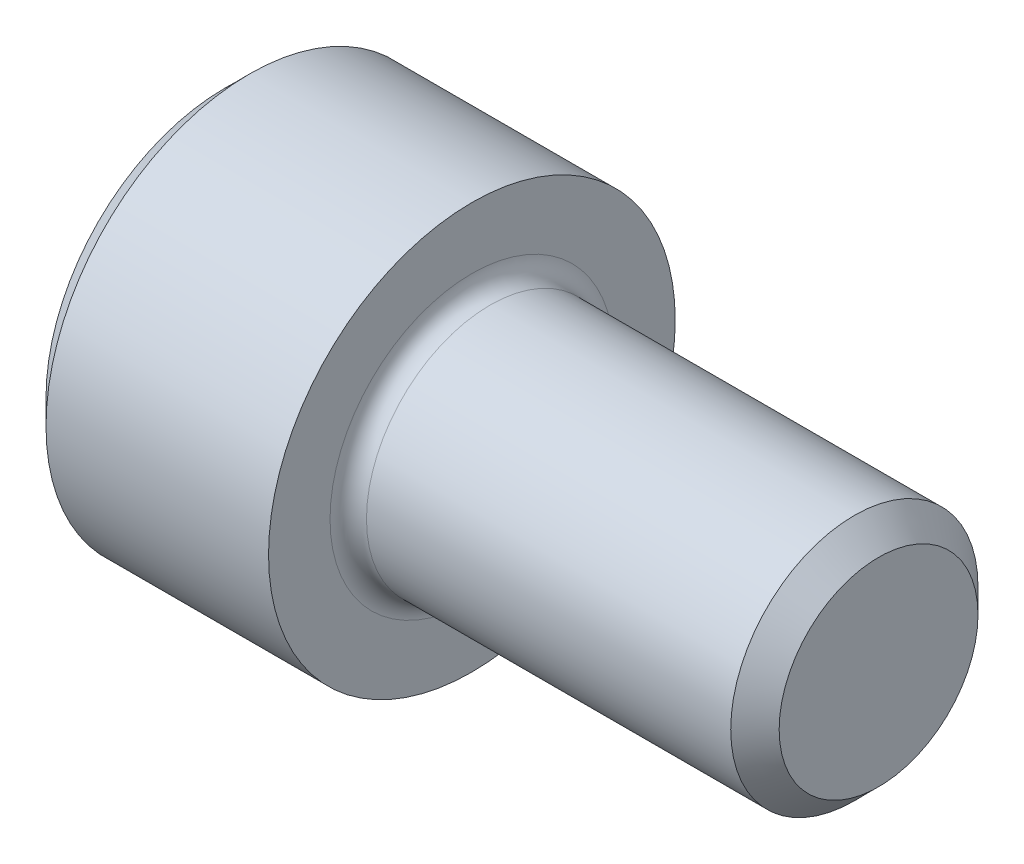
ISO-10303-21;
HEADER;
FILE_DESCRIPTION(('STEP AP214'),'2;1');
FILE_NAME('part.step','',(''),(''),'','','');
FILE_SCHEMA(('AUTOMOTIVE_DESIGN { 1 0 10303 214 1 1 1 1 }'));
ENDSEC;
DATA;
#1=APPLICATION_CONTEXT('core data for automotive mechanical design processes');
#2=APPLICATION_PROTOCOL_DEFINITION('international standard','automotive_design',2000,#1);
#3=PRODUCT_CONTEXT('',#1,'mechanical');
#4=PRODUCT('Part','Part','',(#3));
#5=PRODUCT_RELATED_PRODUCT_CATEGORY('part','',(#4));
#6=PRODUCT_DEFINITION_FORMATION('','',#4);
#7=PRODUCT_DEFINITION_CONTEXT('part definition',#1,'design');
#8=PRODUCT_DEFINITION('design','',#6,#7);
#9=PRODUCT_DEFINITION_SHAPE('','',#8);
#10=(LENGTH_UNIT() NAMED_UNIT(*) SI_UNIT(.MILLI.,.METRE.));
#11=(NAMED_UNIT(*) PLANE_ANGLE_UNIT() SI_UNIT($,.RADIAN.));
#12=(NAMED_UNIT(*) SI_UNIT($,.STERADIAN.) SOLID_ANGLE_UNIT());
#13=UNCERTAINTY_MEASURE_WITH_UNIT(LENGTH_MEASURE(1.E-05),#10,'distance_accuracy_value','');
#14=(GEOMETRIC_REPRESENTATION_CONTEXT(3) GLOBAL_UNCERTAINTY_ASSIGNED_CONTEXT((#13)) GLOBAL_UNIT_ASSIGNED_CONTEXT((#10,
#11,#12)) REPRESENTATION_CONTEXT('',''));
#15=CARTESIAN_POINT('',(0.,0.,0.));
#16=DIRECTION('',(0.,0.,1.));
#17=DIRECTION('',(1.,0.,0.));
#18=AXIS2_PLACEMENT_3D('',#15,#16,#17);
#19=CARTESIAN_POINT('',(0.,0.,0.));
#20=DIRECTION('',(-1.,0.,0.));
#21=DIRECTION('',(0.,0.,1.));
#22=AXIS2_PLACEMENT_3D('',#19,#20,#21);
#23=PLANE('',#22);
#24=DIRECTION('',(0.,-0.499999999999998,0.86602540378444));
#25=VECTOR('',#24,1.);
#26=CARTESIAN_POINT('',(0.,2.2920921156882,0.));
#27=LINE('',#26,#25);
#28=CARTESIAN_POINT('',(0.,2.2920921156882,0.));
#29=VERTEX_POINT('',#28);
#30=CARTESIAN_POINT('',(0.,1.14604605784411,1.98501));
#31=VERTEX_POINT('',#30);
#32=EDGE_CURVE('E259',#29,#31,#27,.T.);
#33=ORIENTED_EDGE('',*,*,#32,.T.);
#34=DIRECTION('',(0.,1.,0.));
#35=VECTOR('',#34,1.);
#36=CARTESIAN_POINT('',(0.,-1.14604605784409,1.98501));
#37=LINE('',#36,#35);
#38=CARTESIAN_POINT('',(0.,-1.14604605784409,1.98501));
#39=VERTEX_POINT('',#38);
#40=EDGE_CURVE('E130',#39,#31,#37,.T.);
#41=ORIENTED_EDGE('',*,*,#40,.F.);
#42=DIRECTION('',(0.,-0.500000000000001,-0.866025403784438));
#43=VECTOR('',#42,1.);
#44=CARTESIAN_POINT('',(0.,-1.14604605784409,1.98501));
#45=LINE('',#44,#43);
#46=CARTESIAN_POINT('',(0.,-2.29209211568819,0.));
#47=VERTEX_POINT('',#46);
#48=EDGE_CURVE('E262',#39,#47,#45,.T.);
#49=ORIENTED_EDGE('',*,*,#48,.T.);
#50=DIRECTION('',(0.,0.499999999999998,-0.86602540378444));
#51=VECTOR('',#50,1.);
#52=CARTESIAN_POINT('',(0.,-2.29209211568819,0.));
#53=LINE('',#52,#51);
#54=CARTESIAN_POINT('',(0.,-1.1460460578441,-1.98501));
#55=VERTEX_POINT('',#54);
#56=EDGE_CURVE('E265',#47,#55,#53,.T.);
#57=ORIENTED_EDGE('',*,*,#56,.T.);
#58=DIRECTION('',(0.,-1.,0.));
#59=VECTOR('',#58,1.);
#60=CARTESIAN_POINT('',(0.,1.1460460578441,-1.98501));
#61=LINE('',#60,#59);
#62=CARTESIAN_POINT('',(0.,1.1460460578441,-1.98501));
#63=VERTEX_POINT('',#62);
#64=EDGE_CURVE('E268',#63,#55,#61,.T.);
#65=ORIENTED_EDGE('',*,*,#64,.F.);
#66=DIRECTION('',(0.,-0.500000000000001,-0.866025403784438));
#67=VECTOR('',#66,1.);
#68=CARTESIAN_POINT('',(0.,2.2920921156882,0.));
#69=LINE('',#68,#67);
#70=EDGE_CURVE('E125',#29,#63,#69,.T.);
#71=ORIENTED_EDGE('',*,*,#70,.F.);
#72=EDGE_LOOP('',(#33,#41,#49,#57,#65,#71));
#73=FACE_BOUND('',#72,.T.);
#74=CARTESIAN_POINT('',(0.,0.,0.));
#75=DIRECTION('',(-1.,0.,0.));
#76=DIRECTION('',(0.,0.,1.));
#77=AXIS2_PLACEMENT_3D('',#74,#75,#76);
#78=CIRCLE('',#77,3.48615);
#79=CARTESIAN_POINT('',(0.,0.,3.48615));
#80=VERTEX_POINT('',#79);
#81=EDGE_CURVE('E154',#80,#80,#78,.T.);
#82=ORIENTED_EDGE('',*,*,#81,.T.);
#83=EDGE_LOOP('',(#82));
#84=FACE_BOUND('',#83,.T.);
#85=ADVANCED_FACE('F34',(#73,#84),#23,.T.);
#86=CARTESIAN_POINT('',(0.,0.,0.));
#87=DIRECTION('',(1.,0.,0.));
#88=DIRECTION('',(0.,0.,-1.));
#89=AXIS2_PLACEMENT_3D('',#86,#87,#88);
#90=CONICAL_SURFACE('',#89,3.48615,0.785398163397446);
#91=CARTESIAN_POINT('',(0.4826,0.,0.));
#92=DIRECTION('',(-1.,0.,0.));
#93=DIRECTION('',(0.,0.,1.));
#94=AXIS2_PLACEMENT_3D('',#91,#92,#93);
#95=CIRCLE('',#94,3.96875);
#96=CARTESIAN_POINT('',(0.4826,0.,3.96875));
#97=VERTEX_POINT('',#96);
#98=EDGE_CURVE('E151',#97,#97,#95,.T.);
#99=ORIENTED_EDGE('',*,*,#98,.T.);
#100=EDGE_LOOP('',(#99));
#101=FACE_BOUND('',#100,.T.);
#102=ORIENTED_EDGE('',*,*,#81,.F.);
#103=EDGE_LOOP('',(#102));
#104=FACE_BOUND('',#103,.T.);
#105=ADVANCED_FACE('F175',(#101,#104),#90,.T.);
#106=CARTESIAN_POINT('',(-31.75,0.,0.));
#107=DIRECTION('',(-1.,0.,0.));
#108=DIRECTION('',(0.,0.,1.));
#109=AXIS2_PLACEMENT_3D('',#106,#107,#108);
#110=CYLINDRICAL_SURFACE('',#109,3.96875);
#111=CARTESIAN_POINT('',(4.826,0.,0.));
#112=DIRECTION('',(-1.,0.,0.));
#113=DIRECTION('',(0.,0.,1.));
#114=AXIS2_PLACEMENT_3D('',#111,#112,#113);
#115=CIRCLE('',#114,3.96875);
#116=CARTESIAN_POINT('',(4.826,0.,3.96875));
#117=VERTEX_POINT('',#116);
#118=EDGE_CURVE('E148',#117,#117,#115,.T.);
#119=ORIENTED_EDGE('',*,*,#118,.T.);
#120=EDGE_LOOP('',(#119));
#121=FACE_BOUND('',#120,.T.);
#122=ORIENTED_EDGE('',*,*,#98,.F.);
#123=EDGE_LOOP('',(#122));
#124=FACE_BOUND('',#123,.T.);
#125=ADVANCED_FACE('F180',(#121,#124),#110,.T.);
#126=CARTESIAN_POINT('',(4.826,3.96875,0.));
#127=DIRECTION('',(1.,0.,0.));
#128=DIRECTION('',(0.,0.,-1.));
#129=AXIS2_PLACEMENT_3D('',#126,#127,#128);
#130=PLANE('',#129);
#131=CARTESIAN_POINT('',(4.826,0.,0.));
#132=DIRECTION('',(1.,0.,0.));
#133=DIRECTION('',(0.,0.,-1.));
#134=AXIS2_PLACEMENT_3D('',#131,#132,#133);
#135=CIRCLE('',#134,2.7686);
#136=CARTESIAN_POINT('',(4.826,0.,-2.7686));
#137=VERTEX_POINT('',#136);
#138=EDGE_CURVE('E42',#137,#137,#135,.F.);
#139=ORIENTED_EDGE('',*,*,#138,.T.);
#140=EDGE_LOOP('',(#139));
#141=FACE_BOUND('',#140,.T.);
#142=ORIENTED_EDGE('',*,*,#118,.F.);
#143=EDGE_LOOP('',(#142));
#144=FACE_BOUND('',#143,.T.);
#145=ADVANCED_FACE('F159',(#141,#144),#130,.T.);
#146=CARTESIAN_POINT('',(-31.75,0.,0.));
#147=DIRECTION('',(-1.,0.,0.));
#148=DIRECTION('',(0.,0.,1.));
#149=AXIS2_PLACEMENT_3D('',#146,#147,#148);
#150=CYLINDRICAL_SURFACE('',#149,2.413);
#151=CARTESIAN_POINT('',(5.1816,0.,0.));
#152=DIRECTION('',(1.,0.,0.));
#153=DIRECTION('',(0.,0.,-1.));
#154=AXIS2_PLACEMENT_3D('',#151,#152,#153);
#155=CIRCLE('',#154,2.413);
#156=CARTESIAN_POINT('',(5.1816,0.,-2.413));
#157=VERTEX_POINT('',#156);
#158=EDGE_CURVE('E11',#157,#157,#155,.T.);
#159=ORIENTED_EDGE('',*,*,#158,.T.);
#160=EDGE_LOOP('',(#159));
#161=FACE_BOUND('',#160,.T.);
#162=CARTESIAN_POINT('',(12.29106,0.,0.));
#163=DIRECTION('',(-1.,0.,0.));
#164=DIRECTION('',(0.,0.,1.));
#165=AXIS2_PLACEMENT_3D('',#162,#163,#164);
#166=CIRCLE('',#165,2.413);
#167=CARTESIAN_POINT('',(12.29106,0.,2.413));
#168=VERTEX_POINT('',#167);
#169=EDGE_CURVE('E145',#168,#168,#166,.T.);
#170=ORIENTED_EDGE('',*,*,#169,.T.);
#171=EDGE_LOOP('',(#170));
#172=FACE_BOUND('',#171,.T.);
#173=ADVANCED_FACE('F190',(#161,#172),#150,.T.);
#174=CARTESIAN_POINT('',(12.7635,0.,0.));
#175=DIRECTION('',(-1.,0.,0.));
#176=DIRECTION('',(0.,0.,1.));
#177=AXIS2_PLACEMENT_3D('',#174,#175,#176);
#178=CONICAL_SURFACE('',#177,1.94056,0.785398163397473);
#179=ORIENTED_EDGE('',*,*,#169,.F.);
#180=EDGE_LOOP('',(#179));
#181=FACE_BOUND('',#180,.T.);
#182=CARTESIAN_POINT('',(12.7635,0.,0.));
#183=DIRECTION('',(-1.,0.,0.));
#184=DIRECTION('',(0.,0.,1.));
#185=AXIS2_PLACEMENT_3D('',#182,#183,#184);
#186=CIRCLE('',#185,1.94056);
#187=CARTESIAN_POINT('',(12.7635,0.,1.94056));
#188=VERTEX_POINT('',#187);
#189=EDGE_CURVE('E141',#188,#188,#186,.T.);
#190=ORIENTED_EDGE('',*,*,#189,.T.);
#191=EDGE_LOOP('',(#190));
#192=FACE_BOUND('',#191,.T.);
#193=ADVANCED_FACE('F170',(#181,#192),#178,.T.);
#194=CARTESIAN_POINT('',(12.7635,1.94056,0.));
#195=DIRECTION('',(1.,0.,0.));
#196=DIRECTION('',(0.,0.,-1.));
#197=AXIS2_PLACEMENT_3D('',#194,#195,#196);
#198=PLANE('',#197);
#199=ORIENTED_EDGE('',*,*,#189,.F.);
#200=EDGE_LOOP('',(#199));
#201=FACE_BOUND('',#200,.T.);
#202=ADVANCED_FACE('F163',(#201),#198,.T.);
#203=CARTESIAN_POINT('',(5.1816,0.,0.));
#204=DIRECTION('',(1.,0.,0.));
#205=DIRECTION('',(0.,0.,-1.));
#206=AXIS2_PLACEMENT_3D('',#203,#204,#205);
#207=TOROIDAL_SURFACE('',#206,2.7686,0.3556);
#208=ORIENTED_EDGE('',*,*,#158,.F.);
#209=EDGE_LOOP('',(#208));
#210=FACE_BOUND('',#209,.T.);
#211=ORIENTED_EDGE('',*,*,#138,.F.);
#212=EDGE_LOOP('',(#211));
#213=FACE_BOUND('',#212,.T.);
#214=ADVANCED_FACE('F36',(#210,#213),#207,.F.);
#215=CARTESIAN_POINT('',(2.286,2.2920921156882,0.));
#216=DIRECTION('',(0.,-0.86602540378444,-0.499999999999998));
#217=DIRECTION('',(0.,0.499999999999998,-0.86602540378444));
#218=AXIS2_PLACEMENT_3D('',#215,#216,#217);
#219=PLANE('',#218);
#220=ORIENTED_EDGE('',*,*,#32,.F.);
#221=DIRECTION('',(-1.,0.,0.));
#222=VECTOR('',#221,1.);
#223=CARTESIAN_POINT('',(2.286,2.2920921156882,0.));
#224=LINE('',#223,#222);
#225=CARTESIAN_POINT('',(2.286,2.2920921156882,0.));
#226=VERTEX_POINT('',#225);
#227=EDGE_CURVE('E249',#226,#29,#224,.T.);
#228=ORIENTED_EDGE('',*,*,#227,.F.);
#229=DIRECTION('',(0.,-0.499999999999998,0.86602540378444));
#230=VECTOR('',#229,1.);
#231=CARTESIAN_POINT('',(2.286,2.2920921156882,0.));
#232=LINE('',#231,#230);
#233=CARTESIAN_POINT('',(2.286,1.71906908676615,0.992504999999998));
#234=VERTEX_POINT('',#233);
#235=EDGE_CURVE('E117',#226,#234,#232,.T.);
#236=ORIENTED_EDGE('',*,*,#235,.T.);
#237=CARTESIAN_POINT('',(2.286,1.14604605784411,1.98501));
#238=VERTEX_POINT('',#237);
#239=EDGE_CURVE('E108',#234,#238,#232,.T.);
#240=ORIENTED_EDGE('',*,*,#239,.T.);
#241=DIRECTION('',(-1.,0.,0.));
#242=VECTOR('',#241,1.);
#243=CARTESIAN_POINT('',(2.286,1.14604605784411,1.98501));
#244=LINE('',#243,#242);
#245=EDGE_CURVE('E122',#238,#31,#244,.T.);
#246=ORIENTED_EDGE('',*,*,#245,.T.);
#247=EDGE_LOOP('',(#220,#228,#236,#240,#246));
#248=FACE_BOUND('',#247,.T.);
#249=ADVANCED_FACE('F121',(#248),#219,.T.);
#250=CARTESIAN_POINT('',(2.286,-1.14604605784409,1.98501));
#251=DIRECTION('',(0.,0.,1.));
#252=DIRECTION('',(0.,-1.,0.));
#253=AXIS2_PLACEMENT_3D('',#250,#251,#252);
#254=PLANE('',#253);
#255=ORIENTED_EDGE('',*,*,#40,.T.);
#256=ORIENTED_EDGE('',*,*,#245,.F.);
#257=DIRECTION('',(0.,1.,0.));
#258=VECTOR('',#257,1.);
#259=CARTESIAN_POINT('',(2.286,-1.14604605784409,1.98501));
#260=LINE('',#259,#258);
#261=CARTESIAN_POINT('',(2.286,0.,1.98501));
#262=VERTEX_POINT('',#261);
#263=EDGE_CURVE('E105',#262,#238,#260,.T.);
#264=ORIENTED_EDGE('',*,*,#263,.F.);
#265=CARTESIAN_POINT('',(2.286,-1.14604605784409,1.98501));
#266=VERTEX_POINT('',#265);
#267=EDGE_CURVE('E116',#266,#262,#260,.T.);
#268=ORIENTED_EDGE('',*,*,#267,.F.);
#269=DIRECTION('',(-1.,0.,0.));
#270=VECTOR('',#269,1.);
#271=CARTESIAN_POINT('',(2.286,-1.14604605784409,1.98501));
#272=LINE('',#271,#270);
#273=EDGE_CURVE('E132',#266,#39,#272,.T.);
#274=ORIENTED_EDGE('',*,*,#273,.T.);
#275=EDGE_LOOP('',(#255,#256,#264,#268,#274));
#276=FACE_BOUND('',#275,.T.);
#277=ADVANCED_FACE('F127',(#276),#254,.F.);
#278=CARTESIAN_POINT('',(2.286,-1.14604605784409,1.98501));
#279=DIRECTION('',(0.,0.866025403784438,-0.500000000000001));
#280=DIRECTION('',(0.,0.500000000000001,0.866025403784438));
#281=AXIS2_PLACEMENT_3D('',#278,#279,#280);
#282=PLANE('',#281);
#283=ORIENTED_EDGE('',*,*,#48,.F.);
#284=ORIENTED_EDGE('',*,*,#273,.F.);
#285=DIRECTION('',(0.,-0.500000000000001,-0.866025403784438));
#286=VECTOR('',#285,1.);
#287=CARTESIAN_POINT('',(2.286,-1.14604605784409,1.98501));
#288=LINE('',#287,#286);
#289=CARTESIAN_POINT('',(2.286,-1.71906908676614,0.992504999999999));
#290=VERTEX_POINT('',#289);
#291=EDGE_CURVE('E288',#266,#290,#288,.T.);
#292=ORIENTED_EDGE('',*,*,#291,.T.);
#293=CARTESIAN_POINT('',(2.286,-2.29209211568819,0.));
#294=VERTEX_POINT('',#293);
#295=EDGE_CURVE('E277',#290,#294,#288,.T.);
#296=ORIENTED_EDGE('',*,*,#295,.T.);
#297=DIRECTION('',(-1.,0.,0.));
#298=VECTOR('',#297,1.);
#299=CARTESIAN_POINT('',(2.286,-2.29209211568819,0.));
#300=LINE('',#299,#298);
#301=EDGE_CURVE('E137',#294,#47,#300,.T.);
#302=ORIENTED_EDGE('',*,*,#301,.T.);
#303=EDGE_LOOP('',(#283,#284,#292,#296,#302));
#304=FACE_BOUND('',#303,.T.);
#305=ADVANCED_FACE('F203',(#304),#282,.T.);
#306=CARTESIAN_POINT('',(2.286,-2.29209211568819,0.));
#307=DIRECTION('',(0.,0.86602540378444,0.499999999999998));
#308=DIRECTION('',(0.,-0.499999999999998,0.86602540378444));
#309=AXIS2_PLACEMENT_3D('',#306,#307,#308);
#310=PLANE('',#309);
#311=ORIENTED_EDGE('',*,*,#56,.F.);
#312=ORIENTED_EDGE('',*,*,#301,.F.);
#313=DIRECTION('',(0.,0.499999999999998,-0.86602540378444));
#314=VECTOR('',#313,1.);
#315=CARTESIAN_POINT('',(2.286,-2.29209211568819,0.));
#316=LINE('',#315,#314);
#317=CARTESIAN_POINT('',(2.286,-1.71906908676615,-0.992504999999995));
#318=VERTEX_POINT('',#317);
#319=EDGE_CURVE('E255',#294,#318,#316,.T.);
#320=ORIENTED_EDGE('',*,*,#319,.T.);
#321=CARTESIAN_POINT('',(2.286,-1.1460460578441,-1.98501));
#322=VERTEX_POINT('',#321);
#323=EDGE_CURVE('E287',#318,#322,#316,.T.);
#324=ORIENTED_EDGE('',*,*,#323,.T.);
#325=DIRECTION('',(-1.,0.,0.));
#326=VECTOR('',#325,1.);
#327=CARTESIAN_POINT('',(2.286,-1.1460460578441,-1.98501));
#328=LINE('',#327,#326);
#329=EDGE_CURVE('E248',#322,#55,#328,.T.);
#330=ORIENTED_EDGE('',*,*,#329,.T.);
#331=EDGE_LOOP('',(#311,#312,#320,#324,#330));
#332=FACE_BOUND('',#331,.T.);
#333=ADVANCED_FACE('F206',(#332),#310,.T.);
#334=CARTESIAN_POINT('',(2.286,1.1460460578441,-1.98501));
#335=DIRECTION('',(0.,0.,-1.));
#336=DIRECTION('',(0.,1.,0.));
#337=AXIS2_PLACEMENT_3D('',#334,#335,#336);
#338=PLANE('',#337);
#339=ORIENTED_EDGE('',*,*,#64,.T.);
#340=ORIENTED_EDGE('',*,*,#329,.F.);
#341=DIRECTION('',(0.,-1.,0.));
#342=VECTOR('',#341,1.);
#343=CARTESIAN_POINT('',(2.286,1.1460460578441,-1.98501));
#344=LINE('',#343,#342);
#345=CARTESIAN_POINT('',(2.286,0.,-1.98501));
#346=VERTEX_POINT('',#345);
#347=EDGE_CURVE('E252',#346,#322,#344,.T.);
#348=ORIENTED_EDGE('',*,*,#347,.F.);
#349=CARTESIAN_POINT('',(2.286,1.1460460578441,-1.98501));
#350=VERTEX_POINT('',#349);
#351=EDGE_CURVE('E49',#350,#346,#344,.T.);
#352=ORIENTED_EDGE('',*,*,#351,.F.);
#353=DIRECTION('',(-1.,0.,0.));
#354=VECTOR('',#353,1.);
#355=CARTESIAN_POINT('',(2.286,1.1460460578441,-1.98501));
#356=LINE('',#355,#354);
#357=EDGE_CURVE('E245',#350,#63,#356,.T.);
#358=ORIENTED_EDGE('',*,*,#357,.T.);
#359=EDGE_LOOP('',(#339,#340,#348,#352,#358));
#360=FACE_BOUND('',#359,.T.);
#361=ADVANCED_FACE('F210',(#360),#338,.F.);
#362=CARTESIAN_POINT('',(2.286,2.2920921156882,0.));
#363=DIRECTION('',(0.,0.866025403784438,-0.500000000000001));
#364=DIRECTION('',(0.,0.500000000000001,0.866025403784438));
#365=AXIS2_PLACEMENT_3D('',#362,#363,#364);
#366=PLANE('',#365);
#367=ORIENTED_EDGE('',*,*,#70,.T.);
#368=ORIENTED_EDGE('',*,*,#357,.F.);
#369=DIRECTION('',(0.,-0.500000000000001,-0.866025403784438));
#370=VECTOR('',#369,1.);
#371=CARTESIAN_POINT('',(2.286,2.2920921156882,0.));
#372=LINE('',#371,#370);
#373=CARTESIAN_POINT('',(2.286,1.71906908676615,-0.992505000000005));
#374=VERTEX_POINT('',#373);
#375=EDGE_CURVE('E235',#374,#350,#372,.T.);
#376=ORIENTED_EDGE('',*,*,#375,.F.);
#377=EDGE_CURVE('E241',#226,#374,#372,.T.);
#378=ORIENTED_EDGE('',*,*,#377,.F.);
#379=ORIENTED_EDGE('',*,*,#227,.T.);
#380=EDGE_LOOP('',(#367,#368,#376,#378,#379));
#381=FACE_BOUND('',#380,.T.);
#382=ADVANCED_FACE('F214',(#381),#366,.F.);
#383=CARTESIAN_POINT('',(2.286,3.4381381735323,-1.98501000000001));
#384=DIRECTION('',(1.,0.,0.));
#385=DIRECTION('',(0.,0.,-1.));
#386=AXIS2_PLACEMENT_3D('',#383,#384,#385);
#387=PLANE('',#386);
#388=ORIENTED_EDGE('',*,*,#347,.T.);
#389=ORIENTED_EDGE('',*,*,#323,.F.);
#390=CARTESIAN_POINT('',(2.286,0.,0.));
#391=DIRECTION('',(-1.,0.,0.));
#392=DIRECTION('',(0.,0.,1.));
#393=AXIS2_PLACEMENT_3D('',#390,#391,#392);
#394=CIRCLE('',#393,1.98501);
#395=EDGE_CURVE('E283',#346,#318,#394,.T.);
#396=ORIENTED_EDGE('',*,*,#395,.F.);
#397=EDGE_LOOP('',(#388,#389,#396));
#398=FACE_BOUND('',#397,.T.);
#399=ADVANCED_FACE('F218',(#398),#387,.F.);
#400=ORIENTED_EDGE('',*,*,#319,.F.);
#401=ORIENTED_EDGE('',*,*,#295,.F.);
#402=EDGE_CURVE('E135',#318,#290,#394,.T.);
#403=ORIENTED_EDGE('',*,*,#402,.F.);
#404=EDGE_LOOP('',(#400,#401,#403));
#405=FACE_BOUND('',#404,.T.);
#406=ADVANCED_FACE('F221',(#405),#387,.F.);
#407=ORIENTED_EDGE('',*,*,#291,.F.);
#408=ORIENTED_EDGE('',*,*,#267,.T.);
#409=EDGE_CURVE('E131',#290,#262,#394,.T.);
#410=ORIENTED_EDGE('',*,*,#409,.F.);
#411=EDGE_LOOP('',(#407,#408,#410));
#412=FACE_BOUND('',#411,.T.);
#413=ADVANCED_FACE('F226',(#412),#387,.F.);
#414=ORIENTED_EDGE('',*,*,#263,.T.);
#415=ORIENTED_EDGE('',*,*,#239,.F.);
#416=EDGE_CURVE('E111',#262,#234,#394,.T.);
#417=ORIENTED_EDGE('',*,*,#416,.F.);
#418=EDGE_LOOP('',(#414,#415,#417));
#419=FACE_BOUND('',#418,.T.);
#420=ADVANCED_FACE('F107',(#419),#387,.F.);
#421=ORIENTED_EDGE('',*,*,#235,.F.);
#422=ORIENTED_EDGE('',*,*,#377,.T.);
#423=EDGE_CURVE('E142',#234,#374,#394,.T.);
#424=ORIENTED_EDGE('',*,*,#423,.F.);
#425=EDGE_LOOP('',(#421,#422,#424));
#426=FACE_BOUND('',#425,.T.);
#427=ADVANCED_FACE('F229',(#426),#387,.F.);
#428=ORIENTED_EDGE('',*,*,#375,.T.);
#429=ORIENTED_EDGE('',*,*,#351,.T.);
#430=EDGE_CURVE('E238',#374,#346,#394,.T.);
#431=ORIENTED_EDGE('',*,*,#430,.F.);
#432=EDGE_LOOP('',(#428,#429,#431));
#433=FACE_BOUND('',#432,.T.);
#434=ADVANCED_FACE('F199',(#433),#387,.F.);
#435=CARTESIAN_POINT('',(2.286,0.,0.));
#436=DIRECTION('',(-1.,0.,0.));
#437=DIRECTION('',(0.,0.,1.));
#438=AXIS2_PLACEMENT_3D('',#435,#436,#437);
#439=CONICAL_SURFACE('',#438,1.98501,1.04719755119659);
#440=CARTESIAN_POINT('',(3.43204605784411,0.,0.));
#441=VERTEX_POINT('',#440);
#442=VERTEX_LOOP('',#441);
#443=FACE_BOUND('',#442,.T.);
#444=ORIENTED_EDGE('',*,*,#416,.T.);
#445=ORIENTED_EDGE('',*,*,#423,.T.);
#446=ORIENTED_EDGE('',*,*,#430,.T.);
#447=ORIENTED_EDGE('',*,*,#395,.T.);
#448=ORIENTED_EDGE('',*,*,#402,.T.);
#449=ORIENTED_EDGE('',*,*,#409,.T.);
#450=EDGE_LOOP('',(#444,#445,#446,#447,#448,#449));
#451=FACE_BOUND('',#450,.T.);
#452=ADVANCED_FACE('F197',(#443,#451),#439,.F.);
#453=CLOSED_SHELL('',(#85,#105,#125,#145,#173,#193,#202,#214,#249,#277,#305,#333,#361,#382,#399,
#406,#413,#420,#427,#434,#452));
#454=MANIFOLD_SOLID_BREP('B2',#453);
#455=ADVANCED_BREP_SHAPE_REPRESENTATION('',(#18,#454),#14);
#456=SHAPE_DEFINITION_REPRESENTATION(#9,#455);
ENDSEC;
END-ISO-10303-21;
